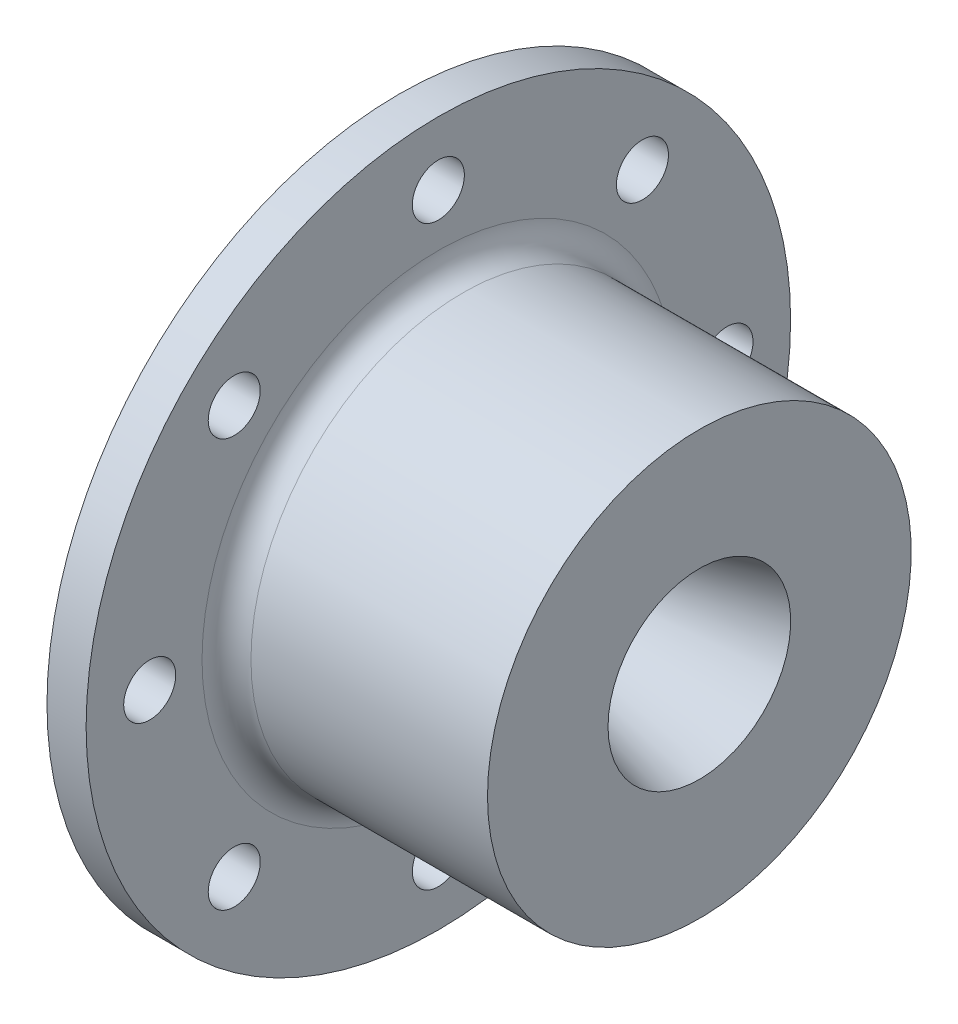
ISO-10303-21;
HEADER;
FILE_DESCRIPTION(('STEP AP214'),'2;1');
FILE_NAME('part.step','',(''),(''),'','','');
FILE_SCHEMA(('AUTOMOTIVE_DESIGN { 1 0 10303 214 1 1 1 1 }'));
ENDSEC;
DATA;
#1=APPLICATION_CONTEXT('core data for automotive mechanical design processes');
#2=APPLICATION_PROTOCOL_DEFINITION('international standard','automotive_design',2000,#1);
#3=PRODUCT_CONTEXT('',#1,'mechanical');
#4=PRODUCT('Part','Part','',(#3));
#5=PRODUCT_RELATED_PRODUCT_CATEGORY('part','',(#4));
#6=PRODUCT_DEFINITION_FORMATION('','',#4);
#7=PRODUCT_DEFINITION_CONTEXT('part definition',#1,'design');
#8=PRODUCT_DEFINITION('design','',#6,#7);
#9=PRODUCT_DEFINITION_SHAPE('','',#8);
#10=(LENGTH_UNIT() NAMED_UNIT(*) SI_UNIT(.MILLI.,.METRE.));
#11=(NAMED_UNIT(*) PLANE_ANGLE_UNIT() SI_UNIT($,.RADIAN.));
#12=(NAMED_UNIT(*) SI_UNIT($,.STERADIAN.) SOLID_ANGLE_UNIT());
#13=UNCERTAINTY_MEASURE_WITH_UNIT(LENGTH_MEASURE(1.E-05),#10,'distance_accuracy_value','');
#14=(GEOMETRIC_REPRESENTATION_CONTEXT(3) GLOBAL_UNCERTAINTY_ASSIGNED_CONTEXT((#13)) GLOBAL_UNIT_ASSIGNED_CONTEXT((#10,
#11,#12)) REPRESENTATION_CONTEXT('',''));
#15=CARTESIAN_POINT('',(0.,0.,0.));
#16=DIRECTION('',(0.,0.,1.));
#17=DIRECTION('',(1.,0.,0.));
#18=AXIS2_PLACEMENT_3D('',#15,#16,#17);
#19=CARTESIAN_POINT('',(0.,25.4,0.));
#20=DIRECTION('',(1.,0.,0.));
#21=DIRECTION('',(0.,0.,-1.));
#22=AXIS2_PLACEMENT_3D('',#19,#20,#21);
#23=PLANE('',#22);
#24=CARTESIAN_POINT('',(0.,0.,-37.465));
#25=DIRECTION('',(-1.,0.,0.));
#26=DIRECTION('',(0.,0.,1.));
#27=AXIS2_PLACEMENT_3D('',#24,#25,#26);
#28=CIRCLE('',#27,3.37819999999999);
#29=CARTESIAN_POINT('',(0.,0.,-34.0868));
#30=VERTEX_POINT('',#29);
#31=EDGE_CURVE('E92',#30,#30,#28,.T.);
#32=ORIENTED_EDGE('',*,*,#31,.F.);
#33=EDGE_LOOP('',(#32));
#34=FACE_BOUND('',#33,.T.);
#35=CARTESIAN_POINT('',(0.,0.,0.));
#36=DIRECTION('',(-1.,0.,0.));
#37=DIRECTION('',(0.,0.,1.));
#38=AXIS2_PLACEMENT_3D('',#35,#36,#37);
#39=CIRCLE('',#38,25.4);
#40=CARTESIAN_POINT('',(0.,0.,25.4));
#41=VERTEX_POINT('',#40);
#42=EDGE_CURVE('E100',#41,#41,#39,.T.);
#43=ORIENTED_EDGE('',*,*,#42,.F.);
#44=EDGE_LOOP('',(#43));
#45=FACE_BOUND('',#44,.T.);
#46=CARTESIAN_POINT('',(0.,26.491755557154,26.491755557154));
#47=DIRECTION('',(-1.,0.,0.));
#48=DIRECTION('',(0.,0.,1.));
#49=AXIS2_PLACEMENT_3D('',#46,#47,#48);
#50=CIRCLE('',#49,3.37819999999999);
#51=CARTESIAN_POINT('',(0.,26.491755557154,29.869955557154));
#52=VERTEX_POINT('',#51);
#53=EDGE_CURVE('E116',#52,#52,#50,.T.);
#54=ORIENTED_EDGE('',*,*,#53,.F.);
#55=EDGE_LOOP('',(#54));
#56=FACE_BOUND('',#55,.T.);
#57=CARTESIAN_POINT('',(0.,37.465,0.));
#58=DIRECTION('',(-1.,0.,0.));
#59=DIRECTION('',(0.,0.,1.));
#60=AXIS2_PLACEMENT_3D('',#57,#58,#59);
#61=CIRCLE('',#60,3.37819999999999);
#62=CARTESIAN_POINT('',(0.,37.465,3.37819999999999));
#63=VERTEX_POINT('',#62);
#64=EDGE_CURVE('E124',#63,#63,#61,.T.);
#65=ORIENTED_EDGE('',*,*,#64,.F.);
#66=EDGE_LOOP('',(#65));
#67=FACE_BOUND('',#66,.T.);
#68=CARTESIAN_POINT('',(0.,26.491755557154,-26.491755557154));
#69=DIRECTION('',(-1.,0.,0.));
#70=DIRECTION('',(0.,0.,1.));
#71=AXIS2_PLACEMENT_3D('',#68,#69,#70);
#72=CIRCLE('',#71,3.37819999999999);
#73=CARTESIAN_POINT('',(0.,26.491755557154,-23.113555557154));
#74=VERTEX_POINT('',#73);
#75=EDGE_CURVE('E132',#74,#74,#72,.T.);
#76=ORIENTED_EDGE('',*,*,#75,.F.);
#77=EDGE_LOOP('',(#76));
#78=FACE_BOUND('',#77,.T.);
#79=CARTESIAN_POINT('',(0.,-26.491755557154,-26.491755557154));
#80=DIRECTION('',(-1.,0.,0.));
#81=DIRECTION('',(0.,0.,1.));
#82=AXIS2_PLACEMENT_3D('',#79,#80,#81);
#83=CIRCLE('',#82,3.37819999999999);
#84=CARTESIAN_POINT('',(0.,-26.491755557154,-23.113555557154));
#85=VERTEX_POINT('',#84);
#86=EDGE_CURVE('E87',#85,#85,#83,.T.);
#87=ORIENTED_EDGE('',*,*,#86,.F.);
#88=EDGE_LOOP('',(#87));
#89=FACE_BOUND('',#88,.T.);
#90=CARTESIAN_POINT('',(0.,-37.465,0.));
#91=DIRECTION('',(-1.,0.,0.));
#92=DIRECTION('',(0.,0.,1.));
#93=AXIS2_PLACEMENT_3D('',#90,#91,#92);
#94=CIRCLE('',#93,3.37819999999999);
#95=CARTESIAN_POINT('',(0.,-37.465,3.37819999999999));
#96=VERTEX_POINT('',#95);
#97=EDGE_CURVE('E82',#96,#96,#94,.T.);
#98=ORIENTED_EDGE('',*,*,#97,.F.);
#99=EDGE_LOOP('',(#98));
#100=FACE_BOUND('',#99,.T.);
#101=CARTESIAN_POINT('',(0.,-26.491755557154,26.491755557154));
#102=DIRECTION('',(-1.,0.,0.));
#103=DIRECTION('',(0.,0.,1.));
#104=AXIS2_PLACEMENT_3D('',#101,#102,#103);
#105=CIRCLE('',#104,3.37819999999999);
#106=CARTESIAN_POINT('',(0.,-26.491755557154,29.869955557154));
#107=VERTEX_POINT('',#106);
#108=EDGE_CURVE('E76',#107,#107,#105,.T.);
#109=ORIENTED_EDGE('',*,*,#108,.F.);
#110=EDGE_LOOP('',(#109));
#111=FACE_BOUND('',#110,.T.);
#112=CARTESIAN_POINT('',(0.,0.,37.465));
#113=DIRECTION('',(-1.,0.,0.));
#114=DIRECTION('',(0.,0.,1.));
#115=AXIS2_PLACEMENT_3D('',#112,#113,#114);
#116=CIRCLE('',#115,3.37819999999999);
#117=CARTESIAN_POINT('',(0.,0.,40.8432));
#118=VERTEX_POINT('',#117);
#119=EDGE_CURVE('E77',#118,#118,#116,.T.);
#120=ORIENTED_EDGE('',*,*,#119,.F.);
#121=EDGE_LOOP('',(#120));
#122=FACE_BOUND('',#121,.T.);
#123=CARTESIAN_POINT('',(0.,0.,0.));
#124=DIRECTION('',(1.,0.,0.));
#125=DIRECTION('',(0.,0.,-1.));
#126=AXIS2_PLACEMENT_3D('',#123,#124,#125);
#127=CIRCLE('',#126,45.72);
#128=CARTESIAN_POINT('',(0.,0.,-45.72));
#129=VERTEX_POINT('',#128);
#130=EDGE_CURVE('E159',#129,#129,#127,.T.);
#131=ORIENTED_EDGE('',*,*,#130,.F.);
#132=EDGE_LOOP('',(#131));
#133=FACE_BOUND('',#132,.T.);
#134=ADVANCED_FACE('F45',(#34,#45,#56,#67,#78,#89,#100,#111,#122,#133),#23,.F.);
#135=CARTESIAN_POINT('',(5.08000000000001,66.870000118,0.));
#136=DIRECTION('',(-1.,0.,0.));
#137=DIRECTION('',(0.,0.,1.));
#138=AXIS2_PLACEMENT_3D('',#135,#136,#137);
#139=PLANE('',#138);
#140=CARTESIAN_POINT('',(5.08000000000001,0.,0.));
#141=DIRECTION('',(-1.,0.,0.));
#142=DIRECTION('',(0.,0.,1.));
#143=AXIS2_PLACEMENT_3D('',#140,#141,#142);
#144=CIRCLE('',#143,30.675000118);
#145=CARTESIAN_POINT('',(5.08000000000001,0.,30.675000118));
#146=VERTEX_POINT('',#145);
#147=EDGE_CURVE('E65',#146,#146,#144,.T.);
#148=ORIENTED_EDGE('',*,*,#147,.T.);
#149=EDGE_LOOP('',(#148));
#150=FACE_BOUND('',#149,.T.);
#151=CARTESIAN_POINT('',(5.08000000000001,26.491755557154,26.491755557154));
#152=DIRECTION('',(-1.,0.,0.));
#153=DIRECTION('',(0.,0.,1.));
#154=AXIS2_PLACEMENT_3D('',#151,#152,#153);
#155=CIRCLE('',#154,3.37819999999999);
#156=CARTESIAN_POINT('',(5.08000000000001,26.491755557154,29.869955557154));
#157=VERTEX_POINT('',#156);
#158=EDGE_CURVE('E112',#157,#157,#155,.T.);
#159=ORIENTED_EDGE('',*,*,#158,.T.);
#160=EDGE_LOOP('',(#159));
#161=FACE_BOUND('',#160,.T.);
#162=CARTESIAN_POINT('',(5.08000000000001,37.465,0.));
#163=DIRECTION('',(-1.,0.,0.));
#164=DIRECTION('',(0.,0.,1.));
#165=AXIS2_PLACEMENT_3D('',#162,#163,#164);
#166=CIRCLE('',#165,3.37819999999999);
#167=CARTESIAN_POINT('',(5.08000000000001,37.465,3.37819999999999));
#168=VERTEX_POINT('',#167);
#169=EDGE_CURVE('E120',#168,#168,#166,.T.);
#170=ORIENTED_EDGE('',*,*,#169,.T.);
#171=EDGE_LOOP('',(#170));
#172=FACE_BOUND('',#171,.T.);
#173=CARTESIAN_POINT('',(5.08000000000001,26.491755557154,-26.491755557154));
#174=DIRECTION('',(-1.,0.,0.));
#175=DIRECTION('',(0.,0.,1.));
#176=AXIS2_PLACEMENT_3D('',#173,#174,#175);
#177=CIRCLE('',#176,3.37819999999999);
#178=CARTESIAN_POINT('',(5.08000000000001,26.491755557154,-23.113555557154));
#179=VERTEX_POINT('',#178);
#180=EDGE_CURVE('E128',#179,#179,#177,.T.);
#181=ORIENTED_EDGE('',*,*,#180,.T.);
#182=EDGE_LOOP('',(#181));
#183=FACE_BOUND('',#182,.T.);
#184=CARTESIAN_POINT('',(5.08000000000001,0.,-37.465));
#185=DIRECTION('',(-1.,0.,0.));
#186=DIRECTION('',(0.,0.,1.));
#187=AXIS2_PLACEMENT_3D('',#184,#185,#186);
#188=CIRCLE('',#187,3.37819999999999);
#189=CARTESIAN_POINT('',(5.08000000000001,0.,-34.0868));
#190=VERTEX_POINT('',#189);
#191=EDGE_CURVE('E136',#190,#190,#188,.T.);
#192=ORIENTED_EDGE('',*,*,#191,.T.);
#193=EDGE_LOOP('',(#192));
#194=FACE_BOUND('',#193,.T.);
#195=CARTESIAN_POINT('',(5.08000000000001,-26.491755557154,-26.491755557154));
#196=DIRECTION('',(-1.,0.,0.));
#197=DIRECTION('',(0.,0.,1.));
#198=AXIS2_PLACEMENT_3D('',#195,#196,#197);
#199=CIRCLE('',#198,3.37819999999999);
#200=CARTESIAN_POINT('',(5.08000000000001,-26.491755557154,-23.113555557154));
#201=VERTEX_POINT('',#200);
#202=EDGE_CURVE('E88',#201,#201,#199,.T.);
#203=ORIENTED_EDGE('',*,*,#202,.T.);
#204=EDGE_LOOP('',(#203));
#205=FACE_BOUND('',#204,.T.);
#206=CARTESIAN_POINT('',(5.08000000000001,-37.465,0.));
#207=DIRECTION('',(-1.,0.,0.));
#208=DIRECTION('',(0.,0.,1.));
#209=AXIS2_PLACEMENT_3D('',#206,#207,#208);
#210=CIRCLE('',#209,3.37819999999999);
#211=CARTESIAN_POINT('',(5.08000000000001,-37.465,3.37819999999999));
#212=VERTEX_POINT('',#211);
#213=EDGE_CURVE('E83',#212,#212,#210,.T.);
#214=ORIENTED_EDGE('',*,*,#213,.T.);
#215=EDGE_LOOP('',(#214));
#216=FACE_BOUND('',#215,.T.);
#217=CARTESIAN_POINT('',(5.08000000000001,-26.491755557154,26.491755557154));
#218=DIRECTION('',(-1.,0.,0.));
#219=DIRECTION('',(0.,0.,1.));
#220=AXIS2_PLACEMENT_3D('',#217,#218,#219);
#221=CIRCLE('',#220,3.37819999999999);
#222=CARTESIAN_POINT('',(5.08000000000001,-26.491755557154,29.869955557154));
#223=VERTEX_POINT('',#222);
#224=EDGE_CURVE('E78',#223,#223,#221,.T.);
#225=ORIENTED_EDGE('',*,*,#224,.T.);
#226=EDGE_LOOP('',(#225));
#227=FACE_BOUND('',#226,.T.);
#228=CARTESIAN_POINT('',(5.08000000000001,0.,37.465));
#229=DIRECTION('',(-1.,0.,0.));
#230=DIRECTION('',(0.,0.,1.));
#231=AXIS2_PLACEMENT_3D('',#228,#229,#230);
#232=CIRCLE('',#231,3.37819999999999);
#233=CARTESIAN_POINT('',(5.08000000000001,0.,40.8432));
#234=VERTEX_POINT('',#233);
#235=EDGE_CURVE('E72',#234,#234,#232,.T.);
#236=ORIENTED_EDGE('',*,*,#235,.T.);
#237=EDGE_LOOP('',(#236));
#238=FACE_BOUND('',#237,.T.);
#239=CARTESIAN_POINT('',(5.08,0.,0.));
#240=DIRECTION('',(-1.,0.,0.));
#241=DIRECTION('',(0.,0.,1.));
#242=AXIS2_PLACEMENT_3D('',#239,#240,#241);
#243=CIRCLE('',#242,45.72);
#244=CARTESIAN_POINT('',(5.08,0.,45.72));
#245=VERTEX_POINT('',#244);
#246=EDGE_CURVE('E155',#245,#245,#243,.T.);
#247=ORIENTED_EDGE('',*,*,#246,.F.);
#248=EDGE_LOOP('',(#247));
#249=FACE_BOUND('',#248,.T.);
#250=ADVANCED_FACE('F168',(#150,#161,#172,#183,#194,#205,#216,#227,#238,#249),#139,.F.);
#251=CARTESIAN_POINT('',(0.,0.,0.));
#252=DIRECTION('',(-1.,0.,0.));
#253=DIRECTION('',(0.,0.,1.));
#254=AXIS2_PLACEMENT_3D('',#251,#252,#253);
#255=CYLINDRICAL_SURFACE('',#254,27.500000118);
#256=CARTESIAN_POINT('',(8.25500000000001,0.,0.));
#257=DIRECTION('',(-1.,0.,0.));
#258=DIRECTION('',(0.,0.,1.));
#259=AXIS2_PLACEMENT_3D('',#256,#257,#258);
#260=CIRCLE('',#259,27.500000118);
#261=CARTESIAN_POINT('',(8.25500000000001,0.,27.500000118));
#262=VERTEX_POINT('',#261);
#263=EDGE_CURVE('E59',#262,#262,#260,.F.);
#264=ORIENTED_EDGE('',*,*,#263,.T.);
#265=EDGE_LOOP('',(#264));
#266=FACE_BOUND('',#265,.T.);
#267=CARTESIAN_POINT('',(38.9578059681494,0.,0.));
#268=DIRECTION('',(-1.,0.,0.));
#269=DIRECTION('',(0.,0.,1.));
#270=AXIS2_PLACEMENT_3D('',#267,#268,#269);
#271=CIRCLE('',#270,27.500000118);
#272=CARTESIAN_POINT('',(38.9578059681494,0.,27.500000118));
#273=VERTEX_POINT('',#272);
#274=EDGE_CURVE('E108',#273,#273,#271,.T.);
#275=ORIENTED_EDGE('',*,*,#274,.T.);
#276=EDGE_LOOP('',(#275));
#277=FACE_BOUND('',#276,.T.);
#278=ADVANCED_FACE('F173',(#266,#277),#255,.T.);
#279=CARTESIAN_POINT('',(0.,0.,0.));
#280=DIRECTION('',(-1.,0.,0.));
#281=DIRECTION('',(0.,0.,1.));
#282=AXIS2_PLACEMENT_3D('',#279,#280,#281);
#283=CONICAL_SURFACE('',#282,25.4,0.872664625997159);
#284=CARTESIAN_POINT('',(12.0598099882206,0.,0.));
#285=DIRECTION('',(1.,0.,0.));
#286=DIRECTION('',(0.,0.,-1.));
#287=AXIS2_PLACEMENT_3D('',#284,#285,#286);
#288=CIRCLE('',#287,11.0276781205348);
#289=CARTESIAN_POINT('',(12.0598099882206,0.,-11.0276781205348));
#290=VERTEX_POINT('',#289);
#291=EDGE_CURVE('E11',#290,#290,#288,.T.);
#292=ORIENTED_EDGE('',*,*,#291,.T.);
#293=EDGE_LOOP('',(#292));
#294=FACE_BOUND('',#293,.T.);
#295=ORIENTED_EDGE('',*,*,#42,.T.);
#296=EDGE_LOOP('',(#295));
#297=FACE_BOUND('',#296,.T.);
#298=ADVANCED_FACE('F179',(#294,#297),#283,.F.);
#299=CARTESIAN_POINT('',(0.,0.,0.));
#300=DIRECTION('',(-1.,0.,0.));
#301=DIRECTION('',(0.,0.,1.));
#302=AXIS2_PLACEMENT_3D('',#299,#300,#301);
#303=CYLINDRICAL_SURFACE('',#302,7.180326);
#304=CARTESIAN_POINT('',(20.3104832363446,0.,0.));
#305=DIRECTION('',(1.,0.,0.));
#306=DIRECTION('',(0.,0.,-1.));
#307=AXIS2_PLACEMENT_3D('',#304,#305,#306);
#308=CIRCLE('',#307,7.180326);
#309=CARTESIAN_POINT('',(20.3104832363446,0.,-7.180326));
#310=VERTEX_POINT('',#309);
#311=EDGE_CURVE('E53',#310,#310,#308,.F.);
#312=ORIENTED_EDGE('',*,*,#311,.T.);
#313=EDGE_LOOP('',(#312));
#314=FACE_BOUND('',#313,.T.);
#315=CARTESIAN_POINT('',(21.1500141343388,0.,0.));
#316=DIRECTION('',(1.,0.,0.));
#317=DIRECTION('',(0.,0.,-1.));
#318=AXIS2_PLACEMENT_3D('',#315,#316,#317);
#319=CIRCLE('',#318,7.180326);
#320=CARTESIAN_POINT('',(21.1500141343388,0.,-7.180326));
#321=VERTEX_POINT('',#320);
#322=EDGE_CURVE('E71',#321,#321,#319,.T.);
#323=ORIENTED_EDGE('',*,*,#322,.T.);
#324=EDGE_LOOP('',(#323));
#325=FACE_BOUND('',#324,.T.);
#326=ADVANCED_FACE('F259',(#314,#325),#303,.F.);
#327=CARTESIAN_POINT('',(21.5111217335704,0.,0.));
#328=DIRECTION('',(1.,0.,0.));
#329=DIRECTION('',(0.,0.,-1.));
#330=AXIS2_PLACEMENT_3D('',#327,#328,#329);
#331=CONICAL_SURFACE('',#330,7.180326,0.261799387799143);
#332=CARTESIAN_POINT('',(21.8599248897375,0.,0.));
#333=DIRECTION('',(-1.,0.,0.));
#334=DIRECTION('',(0.,0.,1.));
#335=AXIS2_PLACEMENT_3D('',#332,#333,#334);
#336=CIRCLE('',#335,7.27378752401239);
#337=CARTESIAN_POINT('',(21.8599248897375,0.,7.27378752401239));
#338=VERTEX_POINT('',#337);
#339=EDGE_CURVE('E96',#338,#338,#336,.T.);
#340=ORIENTED_EDGE('',*,*,#339,.T.);
#341=EDGE_LOOP('',(#340));
#342=FACE_BOUND('',#341,.T.);
#343=CARTESIAN_POINT('',(38.9578059681494,0.,0.));
#344=DIRECTION('',(-1.,0.,0.));
#345=DIRECTION('',(0.,0.,1.));
#346=AXIS2_PLACEMENT_3D('',#343,#344,#345);
#347=CIRCLE('',#346,11.8551509512561);
#348=CARTESIAN_POINT('',(38.9578059681494,0.,11.8551509512561));
#349=VERTEX_POINT('',#348);
#350=EDGE_CURVE('E104',#349,#349,#347,.T.);
#351=ORIENTED_EDGE('',*,*,#350,.F.);
#352=EDGE_LOOP('',(#351));
#353=FACE_BOUND('',#352,.T.);
#354=ADVANCED_FACE('F256',(#342,#353),#331,.F.);
#355=CARTESIAN_POINT('',(38.9578059681494,27.500000118,0.));
#356=DIRECTION('',(-1.,0.,0.));
#357=DIRECTION('',(0.,0.,1.));
#358=AXIS2_PLACEMENT_3D('',#355,#356,#357);
#359=PLANE('',#358);
#360=ORIENTED_EDGE('',*,*,#274,.F.);
#361=EDGE_LOOP('',(#360));
#362=FACE_BOUND('',#361,.T.);
#363=ORIENTED_EDGE('',*,*,#350,.T.);
#364=EDGE_LOOP('',(#363));
#365=FACE_BOUND('',#364,.T.);
#366=ADVANCED_FACE('F188',(#362,#365),#359,.F.);
#367=CARTESIAN_POINT('',(21.1500141343388,0.,0.));
#368=DIRECTION('',(1.,0.,0.));
#369=DIRECTION('',(0.,0.,-1.));
#370=AXIS2_PLACEMENT_3D('',#367,#368,#369);
#371=TOROIDAL_SURFACE('',#370,9.923210532,2.742884532);
#372=ORIENTED_EDGE('',*,*,#322,.F.);
#373=EDGE_LOOP('',(#372));
#374=FACE_BOUND('',#373,.T.);
#375=ORIENTED_EDGE('',*,*,#339,.F.);
#376=EDGE_LOOP('',(#375));
#377=FACE_BOUND('',#376,.T.);
#378=ADVANCED_FACE('F185',(#374,#377),#371,.T.);
#379=CARTESIAN_POINT('',(0.,26.491755557154,26.491755557154));
#380=DIRECTION('',(-1.,0.,0.));
#381=DIRECTION('',(0.,0.,1.));
#382=AXIS2_PLACEMENT_3D('',#379,#380,#381);
#383=CYLINDRICAL_SURFACE('',#382,3.37819999999999);
#384=ORIENTED_EDGE('',*,*,#53,.T.);
#385=EDGE_LOOP('',(#384));
#386=FACE_BOUND('',#385,.T.);
#387=ORIENTED_EDGE('',*,*,#158,.F.);
#388=EDGE_LOOP('',(#387));
#389=FACE_BOUND('',#388,.T.);
#390=ADVANCED_FACE('F187',(#386,#389),#383,.F.);
#391=CARTESIAN_POINT('',(0.,37.465,0.));
#392=DIRECTION('',(-1.,0.,0.));
#393=DIRECTION('',(0.,0.,1.));
#394=AXIS2_PLACEMENT_3D('',#391,#392,#393);
#395=CYLINDRICAL_SURFACE('',#394,3.37819999999999);
#396=ORIENTED_EDGE('',*,*,#64,.T.);
#397=EDGE_LOOP('',(#396));
#398=FACE_BOUND('',#397,.T.);
#399=ORIENTED_EDGE('',*,*,#169,.F.);
#400=EDGE_LOOP('',(#399));
#401=FACE_BOUND('',#400,.T.);
#402=ADVANCED_FACE('F246',(#398,#401),#395,.F.);
#403=CARTESIAN_POINT('',(0.,26.491755557154,-26.491755557154));
#404=DIRECTION('',(-1.,0.,0.));
#405=DIRECTION('',(0.,0.,1.));
#406=AXIS2_PLACEMENT_3D('',#403,#404,#405);
#407=CYLINDRICAL_SURFACE('',#406,3.37819999999999);
#408=ORIENTED_EDGE('',*,*,#75,.T.);
#409=EDGE_LOOP('',(#408));
#410=FACE_BOUND('',#409,.T.);
#411=ORIENTED_EDGE('',*,*,#180,.F.);
#412=EDGE_LOOP('',(#411));
#413=FACE_BOUND('',#412,.T.);
#414=ADVANCED_FACE('F242',(#410,#413),#407,.F.);
#415=CARTESIAN_POINT('',(0.,0.,-37.465));
#416=DIRECTION('',(-1.,0.,0.));
#417=DIRECTION('',(0.,0.,1.));
#418=AXIS2_PLACEMENT_3D('',#415,#416,#417);
#419=CYLINDRICAL_SURFACE('',#418,3.37819999999999);
#420=ORIENTED_EDGE('',*,*,#31,.T.);
#421=EDGE_LOOP('',(#420));
#422=FACE_BOUND('',#421,.T.);
#423=ORIENTED_EDGE('',*,*,#191,.F.);
#424=EDGE_LOOP('',(#423));
#425=FACE_BOUND('',#424,.T.);
#426=ADVANCED_FACE('F238',(#422,#425),#419,.F.);
#427=CARTESIAN_POINT('',(0.,-26.491755557154,-26.491755557154));
#428=DIRECTION('',(-1.,0.,0.));
#429=DIRECTION('',(0.,0.,1.));
#430=AXIS2_PLACEMENT_3D('',#427,#428,#429);
#431=CYLINDRICAL_SURFACE('',#430,3.37819999999999);
#432=ORIENTED_EDGE('',*,*,#86,.T.);
#433=EDGE_LOOP('',(#432));
#434=FACE_BOUND('',#433,.T.);
#435=ORIENTED_EDGE('',*,*,#202,.F.);
#436=EDGE_LOOP('',(#435));
#437=FACE_BOUND('',#436,.T.);
#438=ADVANCED_FACE('F234',(#434,#437),#431,.F.);
#439=CARTESIAN_POINT('',(0.,-37.465,0.));
#440=DIRECTION('',(-1.,0.,0.));
#441=DIRECTION('',(0.,0.,1.));
#442=AXIS2_PLACEMENT_3D('',#439,#440,#441);
#443=CYLINDRICAL_SURFACE('',#442,3.37819999999999);
#444=ORIENTED_EDGE('',*,*,#97,.T.);
#445=EDGE_LOOP('',(#444));
#446=FACE_BOUND('',#445,.T.);
#447=ORIENTED_EDGE('',*,*,#213,.F.);
#448=EDGE_LOOP('',(#447));
#449=FACE_BOUND('',#448,.T.);
#450=ADVANCED_FACE('F228',(#446,#449),#443,.F.);
#451=CARTESIAN_POINT('',(0.,-26.491755557154,26.491755557154));
#452=DIRECTION('',(-1.,0.,0.));
#453=DIRECTION('',(0.,0.,1.));
#454=AXIS2_PLACEMENT_3D('',#451,#452,#453);
#455=CYLINDRICAL_SURFACE('',#454,3.37819999999999);
#456=ORIENTED_EDGE('',*,*,#108,.T.);
#457=EDGE_LOOP('',(#456));
#458=FACE_BOUND('',#457,.T.);
#459=ORIENTED_EDGE('',*,*,#224,.F.);
#460=EDGE_LOOP('',(#459));
#461=FACE_BOUND('',#460,.T.);
#462=ADVANCED_FACE('F223',(#458,#461),#455,.F.);
#463=CARTESIAN_POINT('',(0.,0.,37.465));
#464=DIRECTION('',(-1.,0.,0.));
#465=DIRECTION('',(0.,0.,1.));
#466=AXIS2_PLACEMENT_3D('',#463,#464,#465);
#467=CYLINDRICAL_SURFACE('',#466,3.37819999999999);
#468=ORIENTED_EDGE('',*,*,#119,.T.);
#469=EDGE_LOOP('',(#468));
#470=FACE_BOUND('',#469,.T.);
#471=ORIENTED_EDGE('',*,*,#235,.F.);
#472=EDGE_LOOP('',(#471));
#473=FACE_BOUND('',#472,.T.);
#474=ADVANCED_FACE('F197',(#470,#473),#467,.F.);
#475=CARTESIAN_POINT('',(196.108291387187,0.,0.));
#476=DIRECTION('',(-1.,0.,0.));
#477=DIRECTION('',(0.,0.,1.));
#478=AXIS2_PLACEMENT_3D('',#475,#476,#477);
#479=CYLINDRICAL_SURFACE('',#478,45.72);
#480=ORIENTED_EDGE('',*,*,#246,.T.);
#481=EDGE_LOOP('',(#480));
#482=FACE_BOUND('',#481,.T.);
#483=ORIENTED_EDGE('',*,*,#130,.T.);
#484=EDGE_LOOP('',(#483));
#485=FACE_BOUND('',#484,.T.);
#486=ADVANCED_FACE('F165',(#482,#485),#479,.T.);
#487=CARTESIAN_POINT('',(8.25500000000001,0.,0.));
#488=DIRECTION('',(-1.,0.,0.));
#489=DIRECTION('',(0.,0.,1.));
#490=AXIS2_PLACEMENT_3D('',#487,#488,#489);
#491=TOROIDAL_SURFACE('',#490,30.675000118,3.175);
#492=ORIENTED_EDGE('',*,*,#263,.F.);
#493=EDGE_LOOP('',(#492));
#494=FACE_BOUND('',#493,.T.);
#495=ORIENTED_EDGE('',*,*,#147,.F.);
#496=EDGE_LOOP('',(#495));
#497=FACE_BOUND('',#496,.T.);
#498=ADVANCED_FACE('F190',(#494,#497),#491,.F.);
#499=CARTESIAN_POINT('',(20.3104832363446,0.,0.));
#500=DIRECTION('',(1.,0.,0.));
#501=DIRECTION('',(0.,0.,-1.));
#502=AXIS2_PLACEMENT_3D('',#499,#500,#501);
#503=TOROIDAL_SURFACE('',#502,17.950815,10.770489);
#504=ORIENTED_EDGE('',*,*,#291,.F.);
#505=EDGE_LOOP('',(#504));
#506=FACE_BOUND('',#505,.T.);
#507=ORIENTED_EDGE('',*,*,#311,.F.);
#508=EDGE_LOOP('',(#507));
#509=FACE_BOUND('',#508,.T.);
#510=ADVANCED_FACE('F47',(#506,#509),#503,.T.);
#511=CLOSED_SHELL('',(#134,#250,#278,#298,#326,#354,#366,#378,#390,#402,#414,#426,#438,#450,
#462,#474,#486,#498,#510));
#512=MANIFOLD_SOLID_BREP('B2',#511);
#513=ADVANCED_BREP_SHAPE_REPRESENTATION('',(#18,#512),#14);
#514=SHAPE_DEFINITION_REPRESENTATION(#9,#513);
ENDSEC;
END-ISO-10303-21;
